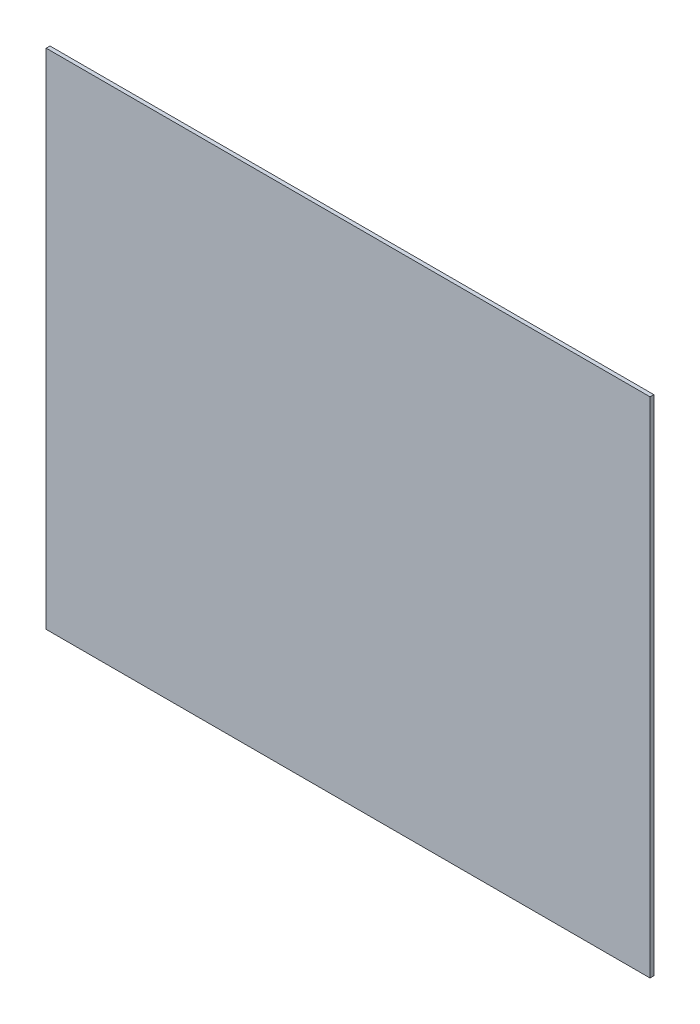
ISO-10303-21;
HEADER;
FILE_DESCRIPTION(('STEP AP214'),'2;1');
FILE_NAME('part.step','',(''),(''),'','','');
FILE_SCHEMA(('AUTOMOTIVE_DESIGN { 1 0 10303 214 1 1 1 1 }'));
ENDSEC;
DATA;
#1=APPLICATION_CONTEXT('core data for automotive mechanical design processes');
#2=APPLICATION_PROTOCOL_DEFINITION('international standard','automotive_design',2000,#1);
#3=PRODUCT_CONTEXT('',#1,'mechanical');
#4=PRODUCT('Part','Part','',(#3));
#5=PRODUCT_RELATED_PRODUCT_CATEGORY('part','',(#4));
#6=PRODUCT_DEFINITION_FORMATION('','',#4);
#7=PRODUCT_DEFINITION_CONTEXT('part definition',#1,'design');
#8=PRODUCT_DEFINITION('design','',#6,#7);
#9=PRODUCT_DEFINITION_SHAPE('','',#8);
#10=(LENGTH_UNIT() NAMED_UNIT(*) SI_UNIT(.MILLI.,.METRE.));
#11=(NAMED_UNIT(*) PLANE_ANGLE_UNIT() SI_UNIT($,.RADIAN.));
#12=(NAMED_UNIT(*) SI_UNIT($,.STERADIAN.) SOLID_ANGLE_UNIT());
#13=UNCERTAINTY_MEASURE_WITH_UNIT(LENGTH_MEASURE(1.E-05),#10,'distance_accuracy_value','');
#14=(GEOMETRIC_REPRESENTATION_CONTEXT(3) GLOBAL_UNCERTAINTY_ASSIGNED_CONTEXT((#13)) GLOBAL_UNIT_ASSIGNED_CONTEXT((#10,
#11,#12)) REPRESENTATION_CONTEXT('',''));
#15=CARTESIAN_POINT('',(0.,0.,0.));
#16=DIRECTION('',(0.,0.,1.));
#17=DIRECTION('',(1.,0.,0.));
#18=AXIS2_PLACEMENT_3D('',#15,#16,#17);
#19=CARTESIAN_POINT('',(237.5,-198.,3.));
#20=DIRECTION('',(-1.,0.,0.));
#21=DIRECTION('',(0.,0.,1.));
#22=AXIS2_PLACEMENT_3D('',#19,#20,#21);
#23=PLANE('',#22);
#24=DIRECTION('',(0.,1.,0.));
#25=VECTOR('',#24,1.);
#26=CARTESIAN_POINT('',(237.5,-198.,0.));
#27=LINE('',#26,#25);
#28=CARTESIAN_POINT('',(237.5,-198.,0.));
#29=VERTEX_POINT('',#28);
#30=CARTESIAN_POINT('',(237.5,198.,0.));
#31=VERTEX_POINT('',#30);
#32=EDGE_CURVE('E99',#29,#31,#27,.T.);
#33=ORIENTED_EDGE('',*,*,#32,.T.);
#34=DIRECTION('',(0.,0.,-1.));
#35=VECTOR('',#34,1.);
#36=CARTESIAN_POINT('',(237.5,198.,3.));
#37=LINE('',#36,#35);
#38=CARTESIAN_POINT('',(237.5,198.,3.));
#39=VERTEX_POINT('',#38);
#40=EDGE_CURVE('E11',#39,#31,#37,.T.);
#41=ORIENTED_EDGE('',*,*,#40,.F.);
#42=DIRECTION('',(0.,1.,0.));
#43=VECTOR('',#42,1.);
#44=CARTESIAN_POINT('',(237.5,-198.,3.));
#45=LINE('',#44,#43);
#46=CARTESIAN_POINT('',(237.5,-198.,3.));
#47=VERTEX_POINT('',#46);
#48=EDGE_CURVE('E87',#47,#39,#45,.T.);
#49=ORIENTED_EDGE('',*,*,#48,.F.);
#50=DIRECTION('',(0.,0.,-1.));
#51=VECTOR('',#50,1.);
#52=CARTESIAN_POINT('',(237.5,-198.,3.));
#53=LINE('',#52,#51);
#54=EDGE_CURVE('E95',#47,#29,#53,.T.);
#55=ORIENTED_EDGE('',*,*,#54,.T.);
#56=EDGE_LOOP('',(#33,#41,#49,#55));
#57=FACE_BOUND('',#56,.T.);
#58=ADVANCED_FACE('F36',(#57),#23,.F.);
#59=CARTESIAN_POINT('',(-237.5,198.,3.));
#60=DIRECTION('',(0.,-1.,0.));
#61=DIRECTION('',(0.,0.,-1.));
#62=AXIS2_PLACEMENT_3D('',#59,#60,#61);
#63=PLANE('',#62);
#64=DIRECTION('',(-1.,0.,0.));
#65=VECTOR('',#64,1.);
#66=CARTESIAN_POINT('',(-237.5,198.,0.));
#67=LINE('',#66,#65);
#68=CARTESIAN_POINT('',(-237.5,198.,0.));
#69=VERTEX_POINT('',#68);
#70=EDGE_CURVE('E91',#31,#69,#67,.T.);
#71=ORIENTED_EDGE('',*,*,#70,.T.);
#72=DIRECTION('',(0.,0.,-1.));
#73=VECTOR('',#72,1.);
#74=CARTESIAN_POINT('',(-237.5,198.,3.));
#75=LINE('',#74,#73);
#76=CARTESIAN_POINT('',(-237.5,198.,3.));
#77=VERTEX_POINT('',#76);
#78=EDGE_CURVE('E44',#77,#69,#75,.T.);
#79=ORIENTED_EDGE('',*,*,#78,.F.);
#80=DIRECTION('',(-1.,0.,0.));
#81=VECTOR('',#80,1.);
#82=CARTESIAN_POINT('',(-237.5,198.,3.));
#83=LINE('',#82,#81);
#84=EDGE_CURVE('E82',#39,#77,#83,.T.);
#85=ORIENTED_EDGE('',*,*,#84,.F.);
#86=ORIENTED_EDGE('',*,*,#40,.T.);
#87=EDGE_LOOP('',(#71,#79,#85,#86));
#88=FACE_BOUND('',#87,.T.);
#89=ADVANCED_FACE('F90',(#88),#63,.F.);
#90=CARTESIAN_POINT('',(-237.5,-198.,3.));
#91=DIRECTION('',(1.,0.,0.));
#92=DIRECTION('',(0.,0.,-1.));
#93=AXIS2_PLACEMENT_3D('',#90,#91,#92);
#94=PLANE('',#93);
#95=DIRECTION('',(0.,-1.,0.));
#96=VECTOR('',#95,1.);
#97=CARTESIAN_POINT('',(-237.5,-198.,0.));
#98=LINE('',#97,#96);
#99=CARTESIAN_POINT('',(-237.5,-198.,0.));
#100=VERTEX_POINT('',#99);
#101=EDGE_CURVE('E69',#69,#100,#98,.T.);
#102=ORIENTED_EDGE('',*,*,#101,.T.);
#103=DIRECTION('',(0.,0.,-1.));
#104=VECTOR('',#103,1.);
#105=CARTESIAN_POINT('',(-237.5,-198.,3.));
#106=LINE('',#105,#104);
#107=CARTESIAN_POINT('',(-237.5,-198.,3.));
#108=VERTEX_POINT('',#107);
#109=EDGE_CURVE('E92',#108,#100,#106,.T.);
#110=ORIENTED_EDGE('',*,*,#109,.F.);
#111=DIRECTION('',(0.,-1.,0.));
#112=VECTOR('',#111,1.);
#113=CARTESIAN_POINT('',(-237.5,-198.,3.));
#114=LINE('',#113,#112);
#115=EDGE_CURVE('E85',#77,#108,#114,.T.);
#116=ORIENTED_EDGE('',*,*,#115,.F.);
#117=ORIENTED_EDGE('',*,*,#78,.T.);
#118=EDGE_LOOP('',(#102,#110,#116,#117));
#119=FACE_BOUND('',#118,.T.);
#120=ADVANCED_FACE('F93',(#119),#94,.F.);
#121=CARTESIAN_POINT('',(-237.5,-198.,3.));
#122=DIRECTION('',(0.,1.,0.));
#123=DIRECTION('',(0.,0.,1.));
#124=AXIS2_PLACEMENT_3D('',#121,#122,#123);
#125=PLANE('',#124);
#126=DIRECTION('',(1.,0.,0.));
#127=VECTOR('',#126,1.);
#128=CARTESIAN_POINT('',(-237.5,-198.,0.));
#129=LINE('',#128,#127);
#130=EDGE_CURVE('E75',#100,#29,#129,.T.);
#131=ORIENTED_EDGE('',*,*,#130,.T.);
#132=ORIENTED_EDGE('',*,*,#54,.F.);
#133=DIRECTION('',(1.,0.,0.));
#134=VECTOR('',#133,1.);
#135=CARTESIAN_POINT('',(-237.5,-198.,3.));
#136=LINE('',#135,#134);
#137=EDGE_CURVE('E52',#108,#47,#136,.T.);
#138=ORIENTED_EDGE('',*,*,#137,.F.);
#139=ORIENTED_EDGE('',*,*,#109,.T.);
#140=EDGE_LOOP('',(#131,#132,#138,#139));
#141=FACE_BOUND('',#140,.T.);
#142=ADVANCED_FACE('F106',(#141),#125,.F.);
#143=CARTESIAN_POINT('',(0.,0.,3.));
#144=DIRECTION('',(0.,0.,-1.));
#145=DIRECTION('',(-1.,0.,0.));
#146=AXIS2_PLACEMENT_3D('',#143,#144,#145);
#147=PLANE('',#146);
#148=ORIENTED_EDGE('',*,*,#48,.T.);
#149=ORIENTED_EDGE('',*,*,#84,.T.);
#150=ORIENTED_EDGE('',*,*,#115,.T.);
#151=ORIENTED_EDGE('',*,*,#137,.T.);
#152=EDGE_LOOP('',(#148,#149,#150,#151));
#153=FACE_BOUND('',#152,.T.);
#154=ADVANCED_FACE('F83',(#153),#147,.F.);
#155=CARTESIAN_POINT('',(0.,0.,0.));
#156=DIRECTION('',(0.,0.,-1.));
#157=DIRECTION('',(-1.,0.,0.));
#158=AXIS2_PLACEMENT_3D('',#155,#156,#157);
#159=PLANE('',#158);
#160=ORIENTED_EDGE('',*,*,#32,.F.);
#161=ORIENTED_EDGE('',*,*,#130,.F.);
#162=ORIENTED_EDGE('',*,*,#101,.F.);
#163=ORIENTED_EDGE('',*,*,#70,.F.);
#164=EDGE_LOOP('',(#160,#161,#162,#163));
#165=FACE_BOUND('',#164,.T.);
#166=ADVANCED_FACE('F109',(#165),#159,.T.);
#167=CLOSED_SHELL('',(#58,#89,#120,#142,#154,#166));
#168=MANIFOLD_SOLID_BREP('B2',#167);
#169=ADVANCED_BREP_SHAPE_REPRESENTATION('',(#18,#168),#14);
#170=SHAPE_DEFINITION_REPRESENTATION(#9,#169);
ENDSEC;
END-ISO-10303-21;
